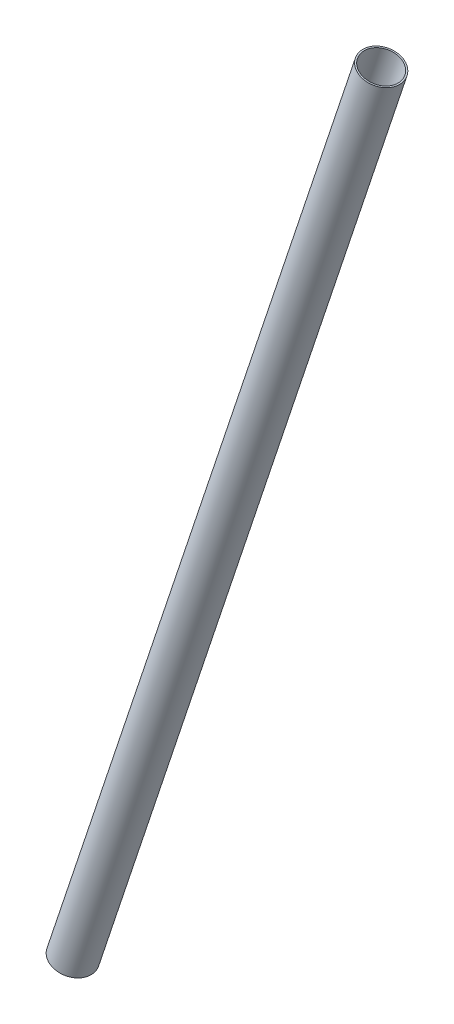
ISO-10303-21;
HEADER;
FILE_DESCRIPTION(('STEP AP214'),'2;1');
FILE_NAME('part.step','',(''),(''),'','','');
FILE_SCHEMA(('AUTOMOTIVE_DESIGN { 1 0 10303 214 1 1 1 1 }'));
ENDSEC;
DATA;
#1=APPLICATION_CONTEXT('core data for automotive mechanical design processes');
#2=APPLICATION_PROTOCOL_DEFINITION('international standard','automotive_design',2000,#1);
#3=PRODUCT_CONTEXT('',#1,'mechanical');
#4=PRODUCT('Part','Part','',(#3));
#5=PRODUCT_RELATED_PRODUCT_CATEGORY('part','',(#4));
#6=PRODUCT_DEFINITION_FORMATION('','',#4);
#7=PRODUCT_DEFINITION_CONTEXT('part definition',#1,'design');
#8=PRODUCT_DEFINITION('design','',#6,#7);
#9=PRODUCT_DEFINITION_SHAPE('','',#8);
#10=(LENGTH_UNIT() NAMED_UNIT(*) SI_UNIT(.MILLI.,.METRE.));
#11=(NAMED_UNIT(*) PLANE_ANGLE_UNIT() SI_UNIT($,.RADIAN.));
#12=(NAMED_UNIT(*) SI_UNIT($,.STERADIAN.) SOLID_ANGLE_UNIT());
#13=UNCERTAINTY_MEASURE_WITH_UNIT(LENGTH_MEASURE(1.E-05),#10,'distance_accuracy_value','');
#14=(GEOMETRIC_REPRESENTATION_CONTEXT(3) GLOBAL_UNCERTAINTY_ASSIGNED_CONTEXT((#13)) GLOBAL_UNIT_ASSIGNED_CONTEXT((#10,
#11,#12)) REPRESENTATION_CONTEXT('',''));
#15=CARTESIAN_POINT('',(0.,0.,0.));
#16=DIRECTION('',(0.,0.,1.));
#17=DIRECTION('',(1.,0.,0.));
#18=AXIS2_PLACEMENT_3D('',#15,#16,#17);
#19=CARTESIAN_POINT('',(19.5217940887934,-15.4319149816284,0.));
#20=DIRECTION('',(0.316227766016838,0.948683298050514,0.));
#21=DIRECTION('',(-0.948683298050514,0.316227766016838,0.));
#22=AXIS2_PLACEMENT_3D('',#19,#20,#21);
#23=PLANE('',#22);
#24=CARTESIAN_POINT('',(-2.6773950856091,-8.03218525682747,0.));
#25=DIRECTION('',(0.316227766016838,0.948683298050514,0.));
#26=DIRECTION('',(-0.948683298050514,0.316227766016838,0.));
#27=AXIS2_PLACEMENT_3D('',#24,#25,#26);
#28=CIRCLE('',#27,25.4);
#29=CARTESIAN_POINT('',(-26.7739508560921,1.99493199737333E-13,0.));
#30=VERTEX_POINT('',#29);
#31=EDGE_CURVE('E60',#30,#30,#28,.T.);
#32=ORIENTED_EDGE('',*,*,#31,.F.);
#33=EDGE_LOOP('',(#32));
#34=FACE_BOUND('',#33,.T.);
#35=CARTESIAN_POINT('',(-2.67739508560921,-8.0321852568277,0.));
#36=DIRECTION('',(0.316227766016838,0.948683298050514,0.));
#37=DIRECTION('',(-0.948683298050514,0.316227766016838,0.));
#38=AXIS2_PLACEMENT_3D('',#35,#36,#37);
#39=CIRCLE('',#38,23.4000000000217);
#40=CARTESIAN_POINT('',(-24.8765842600118,-0.632455532026835,0.));
#41=VERTEX_POINT('',#40);
#42=EDGE_CURVE('E10',#41,#41,#39,.T.);
#43=ORIENTED_EDGE('',*,*,#42,.T.);
#44=EDGE_LOOP('',(#43));
#45=FACE_BOUND('',#44,.T.);
#46=ADVANCED_FACE('F43',(#34,#45),#23,.F.);
#47=CARTESIAN_POINT('',(400.,1200.,0.));
#48=DIRECTION('',(0.316227766016838,0.948683298050514,0.));
#49=DIRECTION('',(-0.948683298050514,0.316227766016838,0.));
#50=AXIS2_PLACEMENT_3D('',#47,#48,#49);
#51=CYLINDRICAL_SURFACE('',#50,23.4000000000218);
#52=ORIENTED_EDGE('',*,*,#42,.F.);
#53=EDGE_LOOP('',(#52));
#54=FACE_BOUND('',#53,.T.);
#55=CARTESIAN_POINT('',(402.677395085609,1208.03218525683,0.));
#56=DIRECTION('',(0.316227766016838,0.948683298050514,0.));
#57=DIRECTION('',(-0.948683298050514,0.316227766016838,0.));
#58=AXIS2_PLACEMENT_3D('',#55,#56,#57);
#59=CIRCLE('',#58,23.400000000022);
#60=CARTESIAN_POINT('',(380.478205911206,1215.43191498163,0.));
#61=VERTEX_POINT('',#60);
#62=EDGE_CURVE('E50',#61,#61,#59,.T.);
#63=ORIENTED_EDGE('',*,*,#62,.T.);
#64=EDGE_LOOP('',(#63));
#65=FACE_BOUND('',#64,.T.);
#66=ADVANCED_FACE('F70',(#54,#65),#51,.F.);
#67=CARTESIAN_POINT('',(424.876584260012,1200.63245553203,0.));
#68=DIRECTION('',(-0.316227766016838,-0.948683298050514,0.));
#69=DIRECTION('',(0.948683298050514,-0.316227766016838,0.));
#70=AXIS2_PLACEMENT_3D('',#67,#68,#69);
#71=PLANE('',#70);
#72=ORIENTED_EDGE('',*,*,#62,.F.);
#73=EDGE_LOOP('',(#72));
#74=FACE_BOUND('',#73,.T.);
#75=CARTESIAN_POINT('',(402.677395085609,1208.03218525683,0.));
#76=DIRECTION('',(0.316227766016838,0.948683298050514,0.));
#77=DIRECTION('',(-0.948683298050514,0.316227766016838,0.));
#78=AXIS2_PLACEMENT_3D('',#75,#76,#77);
#79=CIRCLE('',#78,25.4000000000003);
#80=CARTESIAN_POINT('',(378.580839315126,1216.06437051366,0.));
#81=VERTEX_POINT('',#80);
#82=EDGE_CURVE('E55',#81,#81,#79,.T.);
#83=ORIENTED_EDGE('',*,*,#82,.T.);
#84=EDGE_LOOP('',(#83));
#85=FACE_BOUND('',#84,.T.);
#86=ADVANCED_FACE('F74',(#74,#85),#71,.F.);
#87=CARTESIAN_POINT('',(400.,1200.,0.));
#88=DIRECTION('',(0.316227766016838,0.948683298050514,0.));
#89=DIRECTION('',(-0.948683298050514,0.316227766016838,0.));
#90=AXIS2_PLACEMENT_3D('',#87,#88,#89);
#91=CYLINDRICAL_SURFACE('',#90,25.4000000000001);
#92=ORIENTED_EDGE('',*,*,#82,.F.);
#93=EDGE_LOOP('',(#92));
#94=FACE_BOUND('',#93,.T.);
#95=ORIENTED_EDGE('',*,*,#31,.T.);
#96=EDGE_LOOP('',(#95));
#97=FACE_BOUND('',#96,.T.);
#98=ADVANCED_FACE('F67',(#94,#97),#91,.T.);
#99=CLOSED_SHELL('',(#46,#66,#86,#98));
#100=MANIFOLD_SOLID_BREP('B2',#99);
#101=ADVANCED_BREP_SHAPE_REPRESENTATION('',(#18,#100),#14);
#102=SHAPE_DEFINITION_REPRESENTATION(#9,#101);
ENDSEC;
END-ISO-10303-21;
